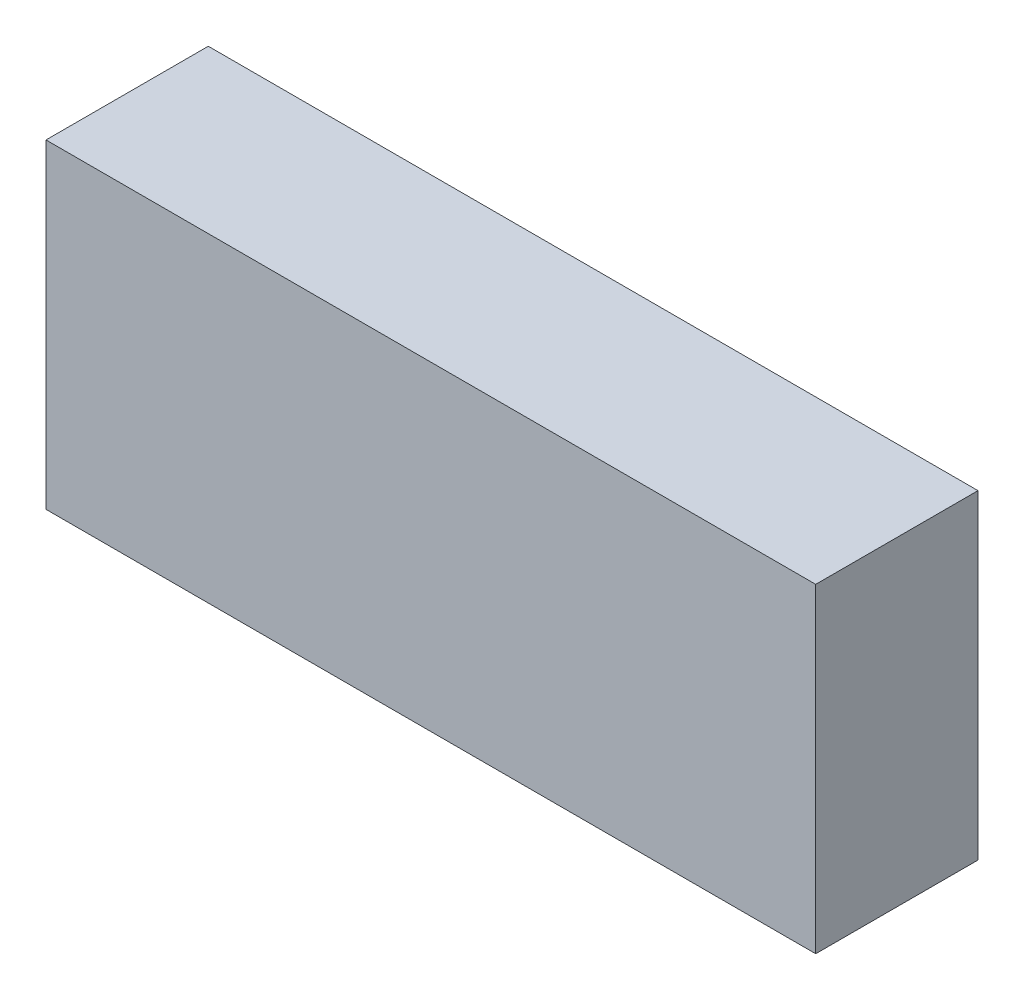
ISO-10303-21;
HEADER;
FILE_DESCRIPTION(('STEP AP214'),'2;1');
FILE_NAME('part.step','',(''),(''),'','','');
FILE_SCHEMA(('AUTOMOTIVE_DESIGN { 1 0 10303 214 1 1 1 1 }'));
ENDSEC;
DATA;
#1=APPLICATION_CONTEXT('core data for automotive mechanical design processes');
#2=APPLICATION_PROTOCOL_DEFINITION('international standard','automotive_design',2000,#1);
#3=PRODUCT_CONTEXT('',#1,'mechanical');
#4=PRODUCT('Part','Part','',(#3));
#5=PRODUCT_RELATED_PRODUCT_CATEGORY('part','',(#4));
#6=PRODUCT_DEFINITION_FORMATION('','',#4);
#7=PRODUCT_DEFINITION_CONTEXT('part definition',#1,'design');
#8=PRODUCT_DEFINITION('design','',#6,#7);
#9=PRODUCT_DEFINITION_SHAPE('','',#8);
#10=(LENGTH_UNIT() NAMED_UNIT(*) SI_UNIT(.MILLI.,.METRE.));
#11=(NAMED_UNIT(*) PLANE_ANGLE_UNIT() SI_UNIT($,.RADIAN.));
#12=(NAMED_UNIT(*) SI_UNIT($,.STERADIAN.) SOLID_ANGLE_UNIT());
#13=UNCERTAINTY_MEASURE_WITH_UNIT(LENGTH_MEASURE(1.E-05),#10,'distance_accuracy_value','');
#14=(GEOMETRIC_REPRESENTATION_CONTEXT(3) GLOBAL_UNCERTAINTY_ASSIGNED_CONTEXT((#13)) GLOBAL_UNIT_ASSIGNED_CONTEXT((#10,
#11,#12)) REPRESENTATION_CONTEXT('',''));
#15=CARTESIAN_POINT('',(0.,0.,0.));
#16=DIRECTION('',(0.,0.,1.));
#17=DIRECTION('',(1.,0.,0.));
#18=AXIS2_PLACEMENT_3D('',#15,#16,#17);
#19=CARTESIAN_POINT('',(0.,69.,0.));
#20=DIRECTION('',(1.,0.,0.));
#21=DIRECTION('',(0.,0.,-1.));
#22=AXIS2_PLACEMENT_3D('',#19,#20,#21);
#23=PLANE('',#22);
#24=DIRECTION('',(0.,0.,1.));
#25=VECTOR('',#24,1.);
#26=CARTESIAN_POINT('',(0.,0.,0.));
#27=LINE('',#26,#25);
#28=CARTESIAN_POINT('',(0.,0.,-35.));
#29=VERTEX_POINT('',#28);
#30=CARTESIAN_POINT('',(0.,0.,0.));
#31=VERTEX_POINT('',#30);
#32=EDGE_CURVE('E114',#29,#31,#27,.T.);
#33=ORIENTED_EDGE('',*,*,#32,.T.);
#34=DIRECTION('',(0.,-1.,0.));
#35=VECTOR('',#34,1.);
#36=CARTESIAN_POINT('',(0.,69.,0.));
#37=LINE('',#36,#35);
#38=CARTESIAN_POINT('',(0.,69.,0.));
#39=VERTEX_POINT('',#38);
#40=EDGE_CURVE('E11',#39,#31,#37,.T.);
#41=ORIENTED_EDGE('',*,*,#40,.F.);
#42=DIRECTION('',(0.,0.,1.));
#43=VECTOR('',#42,1.);
#44=CARTESIAN_POINT('',(0.,69.,0.));
#45=LINE('',#44,#43);
#46=CARTESIAN_POINT('',(0.,69.,-35.));
#47=VERTEX_POINT('',#46);
#48=EDGE_CURVE('E97',#47,#39,#45,.T.);
#49=ORIENTED_EDGE('',*,*,#48,.F.);
#50=DIRECTION('',(0.,-1.,0.));
#51=VECTOR('',#50,1.);
#52=CARTESIAN_POINT('',(0.,69.,-35.));
#53=LINE('',#52,#51);
#54=EDGE_CURVE('E110',#47,#29,#53,.T.);
#55=ORIENTED_EDGE('',*,*,#54,.T.);
#56=EDGE_LOOP('',(#33,#41,#49,#55));
#57=FACE_BOUND('',#56,.T.);
#58=ADVANCED_FACE('F40',(#57),#23,.F.);
#59=CARTESIAN_POINT('',(0.,69.,0.));
#60=DIRECTION('',(0.,0.,-1.));
#61=DIRECTION('',(-1.,0.,0.));
#62=AXIS2_PLACEMENT_3D('',#59,#60,#61);
#63=PLANE('',#62);
#64=DIRECTION('',(1.,0.,0.));
#65=VECTOR('',#64,1.);
#66=CARTESIAN_POINT('',(0.,0.,0.));
#67=LINE('',#66,#65);
#68=CARTESIAN_POINT('',(166.,0.,0.));
#69=VERTEX_POINT('',#68);
#70=EDGE_CURVE('E102',#31,#69,#67,.T.);
#71=ORIENTED_EDGE('',*,*,#70,.T.);
#72=DIRECTION('',(0.,-1.,0.));
#73=VECTOR('',#72,1.);
#74=CARTESIAN_POINT('',(166.,69.,0.));
#75=LINE('',#74,#73);
#76=CARTESIAN_POINT('',(166.,69.,0.));
#77=VERTEX_POINT('',#76);
#78=EDGE_CURVE('E49',#77,#69,#75,.T.);
#79=ORIENTED_EDGE('',*,*,#78,.F.);
#80=DIRECTION('',(1.,0.,0.));
#81=VECTOR('',#80,1.);
#82=CARTESIAN_POINT('',(0.,69.,0.));
#83=LINE('',#82,#81);
#84=EDGE_CURVE('E92',#39,#77,#83,.T.);
#85=ORIENTED_EDGE('',*,*,#84,.F.);
#86=ORIENTED_EDGE('',*,*,#40,.T.);
#87=EDGE_LOOP('',(#71,#79,#85,#86));
#88=FACE_BOUND('',#87,.T.);
#89=ADVANCED_FACE('F101',(#88),#63,.F.);
#90=CARTESIAN_POINT('',(166.,69.,0.));
#91=DIRECTION('',(-1.,0.,0.));
#92=DIRECTION('',(0.,0.,1.));
#93=AXIS2_PLACEMENT_3D('',#90,#91,#92);
#94=PLANE('',#93);
#95=DIRECTION('',(0.,0.,-1.));
#96=VECTOR('',#95,1.);
#97=CARTESIAN_POINT('',(166.,0.,0.));
#98=LINE('',#97,#96);
#99=CARTESIAN_POINT('',(166.,0.,-35.));
#100=VERTEX_POINT('',#99);
#101=EDGE_CURVE('E76',#69,#100,#98,.T.);
#102=ORIENTED_EDGE('',*,*,#101,.T.);
#103=DIRECTION('',(0.,-1.,0.));
#104=VECTOR('',#103,1.);
#105=CARTESIAN_POINT('',(166.,69.,-35.));
#106=LINE('',#105,#104);
#107=CARTESIAN_POINT('',(166.,69.,-35.));
#108=VERTEX_POINT('',#107);
#109=EDGE_CURVE('E104',#108,#100,#106,.T.);
#110=ORIENTED_EDGE('',*,*,#109,.F.);
#111=DIRECTION('',(0.,0.,-1.));
#112=VECTOR('',#111,1.);
#113=CARTESIAN_POINT('',(166.,69.,0.));
#114=LINE('',#113,#112);
#115=EDGE_CURVE('E95',#77,#108,#114,.T.);
#116=ORIENTED_EDGE('',*,*,#115,.F.);
#117=ORIENTED_EDGE('',*,*,#78,.T.);
#118=EDGE_LOOP('',(#102,#110,#116,#117));
#119=FACE_BOUND('',#118,.T.);
#120=ADVANCED_FACE('F105',(#119),#94,.F.);
#121=CARTESIAN_POINT('',(0.,69.,-35.));
#122=DIRECTION('',(0.,0.,1.));
#123=DIRECTION('',(1.,0.,0.));
#124=AXIS2_PLACEMENT_3D('',#121,#122,#123);
#125=PLANE('',#124);
#126=DIRECTION('',(-1.,0.,0.));
#127=VECTOR('',#126,1.);
#128=CARTESIAN_POINT('',(0.,0.,-35.));
#129=LINE('',#128,#127);
#130=EDGE_CURVE('E84',#100,#29,#129,.T.);
#131=ORIENTED_EDGE('',*,*,#130,.T.);
#132=ORIENTED_EDGE('',*,*,#54,.F.);
#133=DIRECTION('',(-1.,0.,0.));
#134=VECTOR('',#133,1.);
#135=CARTESIAN_POINT('',(0.,69.,-35.));
#136=LINE('',#135,#134);
#137=EDGE_CURVE('E57',#108,#47,#136,.T.);
#138=ORIENTED_EDGE('',*,*,#137,.F.);
#139=ORIENTED_EDGE('',*,*,#109,.T.);
#140=EDGE_LOOP('',(#131,#132,#138,#139));
#141=FACE_BOUND('',#140,.T.);
#142=ADVANCED_FACE('F126',(#141),#125,.F.);
#143=CARTESIAN_POINT('',(0.,69.,-35.));
#144=DIRECTION('',(0.,-1.,0.));
#145=DIRECTION('',(0.,0.,-1.));
#146=AXIS2_PLACEMENT_3D('',#143,#144,#145);
#147=PLANE('',#146);
#148=ORIENTED_EDGE('',*,*,#48,.T.);
#149=ORIENTED_EDGE('',*,*,#84,.T.);
#150=ORIENTED_EDGE('',*,*,#115,.T.);
#151=ORIENTED_EDGE('',*,*,#137,.T.);
#152=EDGE_LOOP('',(#148,#149,#150,#151));
#153=FACE_BOUND('',#152,.T.);
#154=ADVANCED_FACE('F93',(#153),#147,.F.);
#155=CARTESIAN_POINT('',(0.,0.,-35.));
#156=DIRECTION('',(0.,-1.,0.));
#157=DIRECTION('',(0.,0.,-1.));
#158=AXIS2_PLACEMENT_3D('',#155,#156,#157);
#159=PLANE('',#158);
#160=ORIENTED_EDGE('',*,*,#32,.F.);
#161=ORIENTED_EDGE('',*,*,#130,.F.);
#162=ORIENTED_EDGE('',*,*,#101,.F.);
#163=ORIENTED_EDGE('',*,*,#70,.F.);
#164=EDGE_LOOP('',(#160,#161,#162,#163));
#165=FACE_BOUND('',#164,.T.);
#166=ADVANCED_FACE('F129',(#165),#159,.T.);
#167=CLOSED_SHELL('',(#58,#89,#120,#142,#154,#166));
#168=MANIFOLD_SOLID_BREP('B2',#167);
#169=ADVANCED_BREP_SHAPE_REPRESENTATION('',(#18,#168),#14);
#170=SHAPE_DEFINITION_REPRESENTATION(#9,#169);
ENDSEC;
END-ISO-10303-21;
